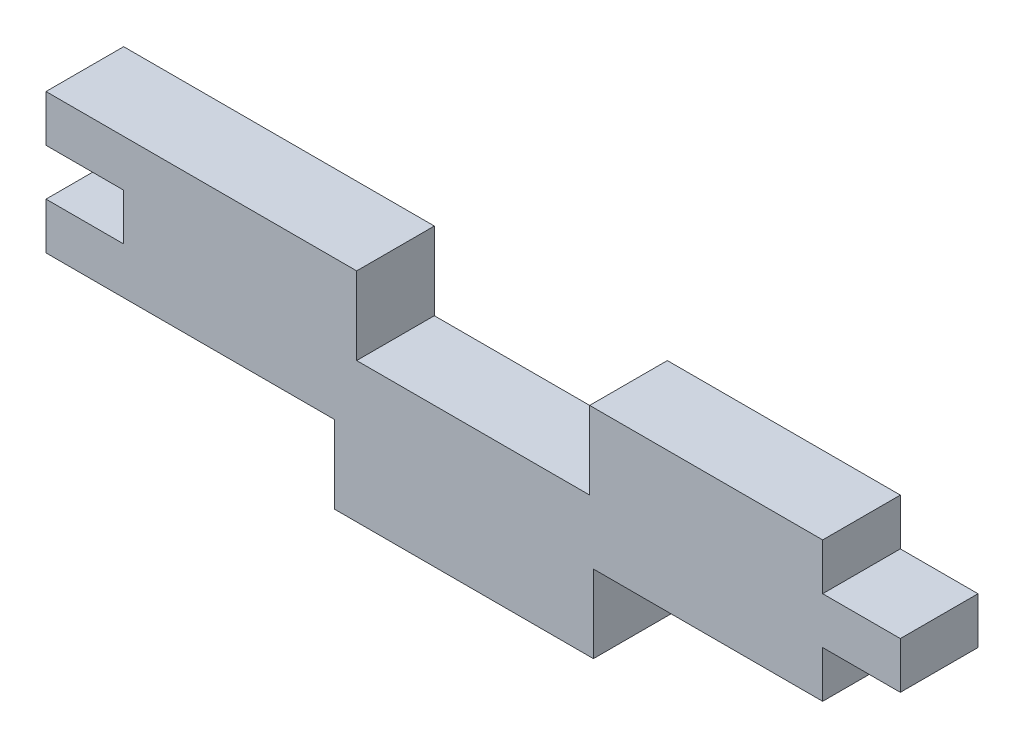
ISO-10303-21;
HEADER;
FILE_DESCRIPTION(('STEP AP214'),'2;1');
FILE_NAME('part.step','',(''),(''),'','','');
FILE_SCHEMA(('AUTOMOTIVE_DESIGN { 1 0 10303 214 1 1 1 1 }'));
ENDSEC;
DATA;
#1=APPLICATION_CONTEXT('core data for automotive mechanical design processes');
#2=APPLICATION_PROTOCOL_DEFINITION('international standard','automotive_design',2000,#1);
#3=PRODUCT_CONTEXT('',#1,'mechanical');
#4=PRODUCT('Part','Part','',(#3));
#5=PRODUCT_RELATED_PRODUCT_CATEGORY('part','',(#4));
#6=PRODUCT_DEFINITION_FORMATION('','',#4);
#7=PRODUCT_DEFINITION_CONTEXT('part definition',#1,'design');
#8=PRODUCT_DEFINITION('design','',#6,#7);
#9=PRODUCT_DEFINITION_SHAPE('','',#8);
#10=(LENGTH_UNIT() NAMED_UNIT(*) SI_UNIT(.MILLI.,.METRE.));
#11=(NAMED_UNIT(*) PLANE_ANGLE_UNIT() SI_UNIT($,.RADIAN.));
#12=(NAMED_UNIT(*) SI_UNIT($,.STERADIAN.) SOLID_ANGLE_UNIT());
#13=UNCERTAINTY_MEASURE_WITH_UNIT(LENGTH_MEASURE(1.E-05),#10,'distance_accuracy_value','');
#14=(GEOMETRIC_REPRESENTATION_CONTEXT(3) GLOBAL_UNCERTAINTY_ASSIGNED_CONTEXT((#13)) GLOBAL_UNIT_ASSIGNED_CONTEXT((#10,
#11,#12)) REPRESENTATION_CONTEXT('',''));
#15=CARTESIAN_POINT('',(0.,0.,0.));
#16=DIRECTION('',(0.,0.,1.));
#17=DIRECTION('',(1.,0.,0.));
#18=AXIS2_PLACEMENT_3D('',#15,#16,#17);
#19=CARTESIAN_POINT('',(-25.,4.5,5.));
#20=DIRECTION('',(0.,-1.,0.));
#21=DIRECTION('',(0.,0.,-1.));
#22=AXIS2_PLACEMENT_3D('',#19,#20,#21);
#23=PLANE('',#22);
#24=DIRECTION('',(0.,0.,-1.));
#25=VECTOR('',#24,1.);
#26=CARTESIAN_POINT('',(9.99999999999999,4.49999999999999,5.00000000000001));
#27=LINE('',#26,#25);
#28=CARTESIAN_POINT('',(9.99999999999999,4.49999999999999,5.00000000000001));
#29=VERTEX_POINT('',#28);
#30=CARTESIAN_POINT('',(9.99999999999999,4.49999999999999,0.));
#31=VERTEX_POINT('',#30);
#32=EDGE_CURVE('E315',#29,#31,#27,.T.);
#33=ORIENTED_EDGE('',*,*,#32,.F.);
#34=DIRECTION('',(-1.,0.,0.));
#35=VECTOR('',#34,1.);
#36=CARTESIAN_POINT('',(-25.,4.5,5.));
#37=LINE('',#36,#35);
#38=CARTESIAN_POINT('',(25.,4.5,5.));
#39=VERTEX_POINT('',#38);
#40=EDGE_CURVE('E312',#39,#29,#37,.T.);
#41=ORIENTED_EDGE('',*,*,#40,.F.);
#42=DIRECTION('',(0.,0.,-1.));
#43=VECTOR('',#42,1.);
#44=CARTESIAN_POINT('',(25.,4.5,5.));
#45=LINE('',#44,#43);
#46=CARTESIAN_POINT('',(25.,4.5,0.));
#47=VERTEX_POINT('',#46);
#48=EDGE_CURVE('E184',#39,#47,#45,.T.);
#49=ORIENTED_EDGE('',*,*,#48,.T.);
#50=DIRECTION('',(-1.,0.,0.));
#51=VECTOR('',#50,1.);
#52=CARTESIAN_POINT('',(-25.,4.5,0.));
#53=LINE('',#52,#51);
#54=EDGE_CURVE('E188',#47,#31,#53,.T.);
#55=ORIENTED_EDGE('',*,*,#54,.T.);
#56=EDGE_LOOP('',(#33,#41,#49,#55));
#57=FACE_BOUND('',#56,.T.);
#58=ADVANCED_FACE('F31',(#57),#23,.F.);
#59=DIRECTION('',(0.,0.,1.));
#60=VECTOR('',#59,1.);
#61=CARTESIAN_POINT('',(-5.00000000000001,4.49999999999999,5.00000000000001));
#62=LINE('',#61,#60);
#63=CARTESIAN_POINT('',(-5.00000000000001,4.49999999999999,0.));
#64=VERTEX_POINT('',#63);
#65=CARTESIAN_POINT('',(-5.00000000000001,4.49999999999999,5.00000000000001));
#66=VERTEX_POINT('',#65);
#67=EDGE_CURVE('E330',#64,#66,#62,.T.);
#68=ORIENTED_EDGE('',*,*,#67,.F.);
#69=CARTESIAN_POINT('',(-25.,4.5,0.));
#70=VERTEX_POINT('',#69);
#71=EDGE_CURVE('E192',#64,#70,#53,.T.);
#72=ORIENTED_EDGE('',*,*,#71,.T.);
#73=DIRECTION('',(0.,0.,-1.));
#74=VECTOR('',#73,1.);
#75=CARTESIAN_POINT('',(-25.,4.5,5.));
#76=LINE('',#75,#74);
#77=CARTESIAN_POINT('',(-25.,4.5,5.));
#78=VERTEX_POINT('',#77);
#79=EDGE_CURVE('E11',#78,#70,#76,.T.);
#80=ORIENTED_EDGE('',*,*,#79,.F.);
#81=EDGE_CURVE('E119',#66,#78,#37,.T.);
#82=ORIENTED_EDGE('',*,*,#81,.F.);
#83=EDGE_LOOP('',(#68,#72,#80,#82));
#84=FACE_BOUND('',#83,.T.);
#85=ADVANCED_FACE('F327',(#84),#23,.F.);
#86=CARTESIAN_POINT('',(25.,4.5,5.));
#87=DIRECTION('',(0.,0.,1.));
#88=DIRECTION('',(1.,0.,0.));
#89=AXIS2_PLACEMENT_3D('',#86,#87,#88);
#90=PLANE('',#89);
#91=DIRECTION('',(1.,0.,0.));
#92=VECTOR('',#91,1.);
#93=CARTESIAN_POINT('',(-25.,1.49999999999999,5.));
#94=LINE('',#93,#92);
#95=CARTESIAN_POINT('',(-25.,1.49999999999999,5.));
#96=VERTEX_POINT('',#95);
#97=CARTESIAN_POINT('',(-20.,1.5,5.));
#98=VERTEX_POINT('',#97);
#99=EDGE_CURVE('E259',#96,#98,#94,.T.);
#100=ORIENTED_EDGE('',*,*,#99,.T.);
#101=DIRECTION('',(0.,-1.,0.));
#102=VECTOR('',#101,1.);
#103=CARTESIAN_POINT('',(-20.,-1.5,5.));
#104=LINE('',#103,#102);
#105=CARTESIAN_POINT('',(-20.,-1.5,5.));
#106=VERTEX_POINT('',#105);
#107=EDGE_CURVE('E280',#98,#106,#104,.T.);
#108=ORIENTED_EDGE('',*,*,#107,.T.);
#109=DIRECTION('',(-1.,0.,0.));
#110=VECTOR('',#109,1.);
#111=CARTESIAN_POINT('',(-25.,-1.5,5.));
#112=LINE('',#111,#110);
#113=CARTESIAN_POINT('',(-25.,-1.5,5.));
#114=VERTEX_POINT('',#113);
#115=EDGE_CURVE('E277',#106,#114,#112,.T.);
#116=ORIENTED_EDGE('',*,*,#115,.T.);
#117=DIRECTION('',(0.,-1.,0.));
#118=VECTOR('',#117,1.);
#119=CARTESIAN_POINT('',(-25.,-4.5,5.));
#120=LINE('',#119,#118);
#121=CARTESIAN_POINT('',(-25.,-4.5,5.));
#122=VERTEX_POINT('',#121);
#123=EDGE_CURVE('E279',#114,#122,#120,.T.);
#124=ORIENTED_EDGE('',*,*,#123,.T.);
#125=DIRECTION('',(1.,0.,0.));
#126=VECTOR('',#125,1.);
#127=CARTESIAN_POINT('',(-25.,-4.5,5.));
#128=LINE('',#127,#126);
#129=CARTESIAN_POINT('',(-6.42413790767914,-4.5,5.));
#130=VERTEX_POINT('',#129);
#131=EDGE_CURVE('E282',#122,#130,#128,.T.);
#132=ORIENTED_EDGE('',*,*,#131,.T.);
#133=DIRECTION('',(0.,-1.,0.));
#134=VECTOR('',#133,1.);
#135=CARTESIAN_POINT('',(-6.42413790767914,-9.5,5.));
#136=LINE('',#135,#134);
#137=CARTESIAN_POINT('',(-6.42413790767914,-9.5,5.));
#138=VERTEX_POINT('',#137);
#139=EDGE_CURVE('E288',#130,#138,#136,.T.);
#140=ORIENTED_EDGE('',*,*,#139,.T.);
#141=DIRECTION('',(1.,0.,0.));
#142=VECTOR('',#141,1.);
#143=CARTESIAN_POINT('',(-6.42413790767914,-9.5,5.));
#144=LINE('',#143,#142);
#145=CARTESIAN_POINT('',(10.2425287589875,-9.5,5.));
#146=VERTEX_POINT('',#145);
#147=EDGE_CURVE('E290',#138,#146,#144,.T.);
#148=ORIENTED_EDGE('',*,*,#147,.T.);
#149=DIRECTION('',(0.,1.,0.));
#150=VECTOR('',#149,1.);
#151=CARTESIAN_POINT('',(10.2425287589875,-9.5,5.));
#152=LINE('',#151,#150);
#153=CARTESIAN_POINT('',(10.2425287589875,-4.5,5.));
#154=VERTEX_POINT('',#153);
#155=EDGE_CURVE('E292',#146,#154,#152,.T.);
#156=ORIENTED_EDGE('',*,*,#155,.T.);
#157=DIRECTION('',(1.,0.,0.));
#158=VECTOR('',#157,1.);
#159=CARTESIAN_POINT('',(10.2425287589875,-4.5,5.));
#160=LINE('',#159,#158);
#161=CARTESIAN_POINT('',(25.,-4.5,5.));
#162=VERTEX_POINT('',#161);
#163=EDGE_CURVE('E294',#154,#162,#160,.T.);
#164=ORIENTED_EDGE('',*,*,#163,.T.);
#165=DIRECTION('',(0.,1.,0.));
#166=VECTOR('',#165,1.);
#167=CARTESIAN_POINT('',(25.,-4.5,5.));
#168=LINE('',#167,#166);
#169=CARTESIAN_POINT('',(25.,-1.49999999999999,5.));
#170=VERTEX_POINT('',#169);
#171=EDGE_CURVE('E296',#162,#170,#168,.T.);
#172=ORIENTED_EDGE('',*,*,#171,.T.);
#173=DIRECTION('',(1.,0.,0.));
#174=VECTOR('',#173,1.);
#175=CARTESIAN_POINT('',(25.,-1.49999999999999,5.));
#176=LINE('',#175,#174);
#177=CARTESIAN_POINT('',(30.,-1.49999999999999,5.));
#178=VERTEX_POINT('',#177);
#179=EDGE_CURVE('E167',#170,#178,#176,.T.);
#180=ORIENTED_EDGE('',*,*,#179,.T.);
#181=DIRECTION('',(0.,1.,0.));
#182=VECTOR('',#181,1.);
#183=CARTESIAN_POINT('',(30.,-1.49999999999999,5.));
#184=LINE('',#183,#182);
#185=CARTESIAN_POINT('',(30.,1.50000000000001,5.));
#186=VERTEX_POINT('',#185);
#187=EDGE_CURVE('E160',#178,#186,#184,.T.);
#188=ORIENTED_EDGE('',*,*,#187,.T.);
#189=DIRECTION('',(-1.,0.,0.));
#190=VECTOR('',#189,1.);
#191=CARTESIAN_POINT('',(25.,1.49999999999999,5.));
#192=LINE('',#191,#190);
#193=CARTESIAN_POINT('',(25.,1.49999999999999,5.));
#194=VERTEX_POINT('',#193);
#195=EDGE_CURVE('E164',#186,#194,#192,.T.);
#196=ORIENTED_EDGE('',*,*,#195,.T.);
#197=DIRECTION('',(0.,1.,0.));
#198=VECTOR('',#197,1.);
#199=CARTESIAN_POINT('',(25.,1.49999999999999,5.));
#200=LINE('',#199,#198);
#201=EDGE_CURVE('E54',#194,#39,#200,.T.);
#202=ORIENTED_EDGE('',*,*,#201,.T.);
#203=ORIENTED_EDGE('',*,*,#40,.T.);
#204=DIRECTION('',(0.,-1.,0.));
#205=VECTOR('',#204,1.);
#206=CARTESIAN_POINT('',(9.99999999999999,4.49999999999999,5.00000000000001));
#207=LINE('',#206,#205);
#208=CARTESIAN_POINT('',(9.99999999999999,-0.500000000000011,5.00000000000001));
#209=VERTEX_POINT('',#208);
#210=EDGE_CURVE('E333',#29,#209,#207,.T.);
#211=ORIENTED_EDGE('',*,*,#210,.T.);
#212=DIRECTION('',(1.,0.,0.));
#213=VECTOR('',#212,1.);
#214=CARTESIAN_POINT('',(25.,-0.500000000000011,5.));
#215=LINE('',#214,#213);
#216=CARTESIAN_POINT('',(-5.00000000000001,-0.500000000000011,5.00000000000001));
#217=VERTEX_POINT('',#216);
#218=EDGE_CURVE('E321',#217,#209,#215,.T.);
#219=ORIENTED_EDGE('',*,*,#218,.F.);
#220=DIRECTION('',(0.,-1.,0.));
#221=VECTOR('',#220,1.);
#222=CARTESIAN_POINT('',(-5.00000000000001,4.49999999999999,5.00000000000001));
#223=LINE('',#222,#221);
#224=EDGE_CURVE('E346',#66,#217,#223,.T.);
#225=ORIENTED_EDGE('',*,*,#224,.F.);
#226=ORIENTED_EDGE('',*,*,#81,.T.);
#227=DIRECTION('',(0.,-1.,0.));
#228=VECTOR('',#227,1.);
#229=CARTESIAN_POINT('',(-25.,1.49999999999999,5.));
#230=LINE('',#229,#228);
#231=EDGE_CURVE('E317',#78,#96,#230,.T.);
#232=ORIENTED_EDGE('',*,*,#231,.T.);
#233=EDGE_LOOP('',(#100,#108,#116,#124,#132,#140,#148,#156,#164,#172,#180,#188,#196,#202,#203,
#211,#219,#225,#226,#232));
#234=FACE_BOUND('',#233,.T.);
#235=ADVANCED_FACE('F162',(#234),#90,.T.);
#236=CARTESIAN_POINT('',(25.,4.5,0.));
#237=DIRECTION('',(0.,0.,1.));
#238=DIRECTION('',(1.,0.,0.));
#239=AXIS2_PLACEMENT_3D('',#236,#237,#238);
#240=PLANE('',#239);
#241=DIRECTION('',(0.,-1.,0.));
#242=VECTOR('',#241,1.);
#243=CARTESIAN_POINT('',(9.99999999999999,4.49999999999999,0.));
#244=LINE('',#243,#242);
#245=CARTESIAN_POINT('',(9.99999999999999,-0.500000000000011,0.));
#246=VERTEX_POINT('',#245);
#247=EDGE_CURVE('E339',#31,#246,#244,.T.);
#248=ORIENTED_EDGE('',*,*,#247,.F.);
#249=ORIENTED_EDGE('',*,*,#54,.F.);
#250=DIRECTION('',(0.,1.,0.));
#251=VECTOR('',#250,1.);
#252=CARTESIAN_POINT('',(25.,1.49999999999999,0.));
#253=LINE('',#252,#251);
#254=CARTESIAN_POINT('',(25.,1.49999999999999,0.));
#255=VERTEX_POINT('',#254);
#256=EDGE_CURVE('E111',#255,#47,#253,.T.);
#257=ORIENTED_EDGE('',*,*,#256,.F.);
#258=DIRECTION('',(-1.,0.,0.));
#259=VECTOR('',#258,1.);
#260=CARTESIAN_POINT('',(25.,1.49999999999999,0.));
#261=LINE('',#260,#259);
#262=CARTESIAN_POINT('',(30.,1.50000000000001,0.));
#263=VERTEX_POINT('',#262);
#264=EDGE_CURVE('E217',#263,#255,#261,.T.);
#265=ORIENTED_EDGE('',*,*,#264,.F.);
#266=DIRECTION('',(0.,1.,0.));
#267=VECTOR('',#266,1.);
#268=CARTESIAN_POINT('',(30.,-1.49999999999999,0.));
#269=LINE('',#268,#267);
#270=CARTESIAN_POINT('',(30.,-1.49999999999999,0.));
#271=VERTEX_POINT('',#270);
#272=EDGE_CURVE('E176',#271,#263,#269,.T.);
#273=ORIENTED_EDGE('',*,*,#272,.F.);
#274=DIRECTION('',(1.,0.,0.));
#275=VECTOR('',#274,1.);
#276=CARTESIAN_POINT('',(25.,-1.49999999999999,0.));
#277=LINE('',#276,#275);
#278=CARTESIAN_POINT('',(25.,-1.49999999999999,0.));
#279=VERTEX_POINT('',#278);
#280=EDGE_CURVE('E214',#279,#271,#277,.T.);
#281=ORIENTED_EDGE('',*,*,#280,.F.);
#282=DIRECTION('',(0.,1.,0.));
#283=VECTOR('',#282,1.);
#284=CARTESIAN_POINT('',(25.,-4.5,0.));
#285=LINE('',#284,#283);
#286=CARTESIAN_POINT('',(25.,-4.5,0.));
#287=VERTEX_POINT('',#286);
#288=EDGE_CURVE('E212',#287,#279,#285,.T.);
#289=ORIENTED_EDGE('',*,*,#288,.F.);
#290=DIRECTION('',(1.,0.,0.));
#291=VECTOR('',#290,1.);
#292=CARTESIAN_POINT('',(10.2425287589875,-4.5,0.));
#293=LINE('',#292,#291);
#294=CARTESIAN_POINT('',(10.2425287589875,-4.5,0.));
#295=VERTEX_POINT('',#294);
#296=EDGE_CURVE('E210',#295,#287,#293,.T.);
#297=ORIENTED_EDGE('',*,*,#296,.F.);
#298=DIRECTION('',(0.,1.,0.));
#299=VECTOR('',#298,1.);
#300=CARTESIAN_POINT('',(10.2425287589875,-9.5,0.));
#301=LINE('',#300,#299);
#302=CARTESIAN_POINT('',(10.2425287589875,-9.5,0.));
#303=VERTEX_POINT('',#302);
#304=EDGE_CURVE('E208',#303,#295,#301,.T.);
#305=ORIENTED_EDGE('',*,*,#304,.F.);
#306=DIRECTION('',(1.,0.,0.));
#307=VECTOR('',#306,1.);
#308=CARTESIAN_POINT('',(-6.42413790767914,-9.5,0.));
#309=LINE('',#308,#307);
#310=CARTESIAN_POINT('',(-6.42413790767914,-9.5,0.));
#311=VERTEX_POINT('',#310);
#312=EDGE_CURVE('E206',#311,#303,#309,.T.);
#313=ORIENTED_EDGE('',*,*,#312,.F.);
#314=DIRECTION('',(0.,-1.,0.));
#315=VECTOR('',#314,1.);
#316=CARTESIAN_POINT('',(-6.42413790767914,-9.5,0.));
#317=LINE('',#316,#315);
#318=CARTESIAN_POINT('',(-6.42413790767914,-4.5,0.));
#319=VERTEX_POINT('',#318);
#320=EDGE_CURVE('E204',#319,#311,#317,.T.);
#321=ORIENTED_EDGE('',*,*,#320,.F.);
#322=DIRECTION('',(1.,0.,0.));
#323=VECTOR('',#322,1.);
#324=CARTESIAN_POINT('',(-25.,-4.5,0.));
#325=LINE('',#324,#323);
#326=CARTESIAN_POINT('',(-25.,-4.5,0.));
#327=VERTEX_POINT('',#326);
#328=EDGE_CURVE('E202',#327,#319,#325,.T.);
#329=ORIENTED_EDGE('',*,*,#328,.F.);
#330=DIRECTION('',(0.,-1.,0.));
#331=VECTOR('',#330,1.);
#332=CARTESIAN_POINT('',(-25.,-4.5,0.));
#333=LINE('',#332,#331);
#334=CARTESIAN_POINT('',(-25.,-1.5,0.));
#335=VERTEX_POINT('',#334);
#336=EDGE_CURVE('E200',#335,#327,#333,.T.);
#337=ORIENTED_EDGE('',*,*,#336,.F.);
#338=DIRECTION('',(-1.,0.,0.));
#339=VECTOR('',#338,1.);
#340=CARTESIAN_POINT('',(-25.,-1.5,0.));
#341=LINE('',#340,#339);
#342=CARTESIAN_POINT('',(-20.,-1.5,0.));
#343=VERTEX_POINT('',#342);
#344=EDGE_CURVE('E198',#343,#335,#341,.T.);
#345=ORIENTED_EDGE('',*,*,#344,.F.);
#346=DIRECTION('',(0.,-1.,0.));
#347=VECTOR('',#346,1.);
#348=CARTESIAN_POINT('',(-20.,-1.5,0.));
#349=LINE('',#348,#347);
#350=CARTESIAN_POINT('',(-20.,1.5,0.));
#351=VERTEX_POINT('',#350);
#352=EDGE_CURVE('E196',#351,#343,#349,.T.);
#353=ORIENTED_EDGE('',*,*,#352,.F.);
#354=DIRECTION('',(1.,0.,0.));
#355=VECTOR('',#354,1.);
#356=CARTESIAN_POINT('',(-25.,1.49999999999999,0.));
#357=LINE('',#356,#355);
#358=CARTESIAN_POINT('',(-25.,1.49999999999999,0.));
#359=VERTEX_POINT('',#358);
#360=EDGE_CURVE('E194',#359,#351,#357,.T.);
#361=ORIENTED_EDGE('',*,*,#360,.F.);
#362=DIRECTION('',(0.,-1.,0.));
#363=VECTOR('',#362,1.);
#364=CARTESIAN_POINT('',(-25.,1.49999999999999,0.));
#365=LINE('',#364,#363);
#366=EDGE_CURVE('E191',#70,#359,#365,.T.);
#367=ORIENTED_EDGE('',*,*,#366,.F.);
#368=ORIENTED_EDGE('',*,*,#71,.F.);
#369=DIRECTION('',(0.,-1.,0.));
#370=VECTOR('',#369,1.);
#371=CARTESIAN_POINT('',(-5.00000000000001,4.49999999999999,0.));
#372=LINE('',#371,#370);
#373=CARTESIAN_POINT('',(-5.00000000000001,-0.500000000000011,0.));
#374=VERTEX_POINT('',#373);
#375=EDGE_CURVE('E342',#64,#374,#372,.T.);
#376=ORIENTED_EDGE('',*,*,#375,.T.);
#377=DIRECTION('',(-1.,0.,0.));
#378=VECTOR('',#377,1.);
#379=CARTESIAN_POINT('',(-5.00000000000001,-0.500000000000011,0.));
#380=LINE('',#379,#378);
#381=EDGE_CURVE('E349',#246,#374,#380,.T.);
#382=ORIENTED_EDGE('',*,*,#381,.F.);
#383=EDGE_LOOP('',(#248,#249,#257,#265,#273,#281,#289,#297,#305,#313,#321,#329,#337,#345,#353,
#361,#367,#368,#376,#382));
#384=FACE_BOUND('',#383,.T.);
#385=ADVANCED_FACE('F265',(#384),#240,.F.);
#386=CARTESIAN_POINT('',(-25.,1.49999999999999,5.));
#387=DIRECTION('',(1.,0.,0.));
#388=DIRECTION('',(0.,1.,0.));
#389=AXIS2_PLACEMENT_3D('',#386,#387,#388);
#390=PLANE('',#389);
#391=ORIENTED_EDGE('',*,*,#366,.T.);
#392=DIRECTION('',(0.,0.,-1.));
#393=VECTOR('',#392,1.);
#394=CARTESIAN_POINT('',(-25.,1.49999999999999,5.));
#395=LINE('',#394,#393);
#396=EDGE_CURVE('E38',#96,#359,#395,.T.);
#397=ORIENTED_EDGE('',*,*,#396,.F.);
#398=ORIENTED_EDGE('',*,*,#231,.F.);
#399=ORIENTED_EDGE('',*,*,#79,.T.);
#400=EDGE_LOOP('',(#391,#397,#398,#399));
#401=FACE_BOUND('',#400,.T.);
#402=ADVANCED_FACE('F324',(#401),#390,.F.);
#403=CARTESIAN_POINT('',(-25.,1.49999999999999,5.));
#404=DIRECTION('',(0.,1.,0.));
#405=DIRECTION('',(-1.,0.,0.));
#406=AXIS2_PLACEMENT_3D('',#403,#404,#405);
#407=PLANE('',#406);
#408=ORIENTED_EDGE('',*,*,#360,.T.);
#409=DIRECTION('',(0.,0.,-1.));
#410=VECTOR('',#409,1.);
#411=CARTESIAN_POINT('',(-20.,1.5,5.));
#412=LINE('',#411,#410);
#413=EDGE_CURVE('E250',#98,#351,#412,.T.);
#414=ORIENTED_EDGE('',*,*,#413,.F.);
#415=ORIENTED_EDGE('',*,*,#99,.F.);
#416=ORIENTED_EDGE('',*,*,#396,.T.);
#417=EDGE_LOOP('',(#408,#414,#415,#416));
#418=FACE_BOUND('',#417,.T.);
#419=ADVANCED_FACE('F257',(#418),#407,.F.);
#420=CARTESIAN_POINT('',(-20.,-1.5,5.));
#421=DIRECTION('',(1.,0.,0.));
#422=DIRECTION('',(0.,0.,-1.));
#423=AXIS2_PLACEMENT_3D('',#420,#421,#422);
#424=PLANE('',#423);
#425=ORIENTED_EDGE('',*,*,#352,.T.);
#426=DIRECTION('',(0.,0.,-1.));
#427=VECTOR('',#426,1.);
#428=CARTESIAN_POINT('',(-20.,-1.5,5.));
#429=LINE('',#428,#427);
#430=EDGE_CURVE('E247',#106,#343,#429,.T.);
#431=ORIENTED_EDGE('',*,*,#430,.F.);
#432=ORIENTED_EDGE('',*,*,#107,.F.);
#433=ORIENTED_EDGE('',*,*,#413,.T.);
#434=EDGE_LOOP('',(#425,#431,#432,#433));
#435=FACE_BOUND('',#434,.T.);
#436=ADVANCED_FACE('F271',(#435),#424,.F.);
#437=CARTESIAN_POINT('',(-25.,-1.5,5.));
#438=DIRECTION('',(0.,-1.,0.));
#439=DIRECTION('',(0.,0.,-1.));
#440=AXIS2_PLACEMENT_3D('',#437,#438,#439);
#441=PLANE('',#440);
#442=ORIENTED_EDGE('',*,*,#344,.T.);
#443=DIRECTION('',(0.,0.,-1.));
#444=VECTOR('',#443,1.);
#445=CARTESIAN_POINT('',(-25.,-1.5,5.));
#446=LINE('',#445,#444);
#447=EDGE_CURVE('E244',#114,#335,#446,.T.);
#448=ORIENTED_EDGE('',*,*,#447,.F.);
#449=ORIENTED_EDGE('',*,*,#115,.F.);
#450=ORIENTED_EDGE('',*,*,#430,.T.);
#451=EDGE_LOOP('',(#442,#448,#449,#450));
#452=FACE_BOUND('',#451,.T.);
#453=ADVANCED_FACE('F275',(#452),#441,.F.);
#454=CARTESIAN_POINT('',(-25.,-4.5,5.));
#455=DIRECTION('',(1.,0.,0.));
#456=DIRECTION('',(0.,0.,-1.));
#457=AXIS2_PLACEMENT_3D('',#454,#455,#456);
#458=PLANE('',#457);
#459=ORIENTED_EDGE('',*,*,#336,.T.);
#460=DIRECTION('',(0.,0.,-1.));
#461=VECTOR('',#460,1.);
#462=CARTESIAN_POINT('',(-25.,-4.5,5.));
#463=LINE('',#462,#461);
#464=EDGE_CURVE('E241',#122,#327,#463,.T.);
#465=ORIENTED_EDGE('',*,*,#464,.F.);
#466=ORIENTED_EDGE('',*,*,#123,.F.);
#467=ORIENTED_EDGE('',*,*,#447,.T.);
#468=EDGE_LOOP('',(#459,#465,#466,#467));
#469=FACE_BOUND('',#468,.T.);
#470=ADVANCED_FACE('F416',(#469),#458,.F.);
#471=CARTESIAN_POINT('',(-25.,-4.5,5.));
#472=DIRECTION('',(0.,1.,0.));
#473=DIRECTION('',(0.,0.,1.));
#474=AXIS2_PLACEMENT_3D('',#471,#472,#473);
#475=PLANE('',#474);
#476=ORIENTED_EDGE('',*,*,#328,.T.);
#477=DIRECTION('',(0.,0.,-1.));
#478=VECTOR('',#477,1.);
#479=CARTESIAN_POINT('',(-6.42413790767914,-4.5,5.));
#480=LINE('',#479,#478);
#481=EDGE_CURVE('E238',#130,#319,#480,.T.);
#482=ORIENTED_EDGE('',*,*,#481,.F.);
#483=ORIENTED_EDGE('',*,*,#131,.F.);
#484=ORIENTED_EDGE('',*,*,#464,.T.);
#485=EDGE_LOOP('',(#476,#482,#483,#484));
#486=FACE_BOUND('',#485,.T.);
#487=ADVANCED_FACE('F412',(#486),#475,.F.);
#488=CARTESIAN_POINT('',(-6.42413790767914,-9.5,5.));
#489=DIRECTION('',(1.,0.,0.));
#490=DIRECTION('',(0.,0.,-1.));
#491=AXIS2_PLACEMENT_3D('',#488,#489,#490);
#492=PLANE('',#491);
#493=ORIENTED_EDGE('',*,*,#320,.T.);
#494=DIRECTION('',(0.,0.,-1.));
#495=VECTOR('',#494,1.);
#496=CARTESIAN_POINT('',(-6.42413790767914,-9.5,5.));
#497=LINE('',#496,#495);
#498=EDGE_CURVE('E235',#138,#311,#497,.T.);
#499=ORIENTED_EDGE('',*,*,#498,.F.);
#500=ORIENTED_EDGE('',*,*,#139,.F.);
#501=ORIENTED_EDGE('',*,*,#481,.T.);
#502=EDGE_LOOP('',(#493,#499,#500,#501));
#503=FACE_BOUND('',#502,.T.);
#504=ADVANCED_FACE('F408',(#503),#492,.F.);
#505=CARTESIAN_POINT('',(-6.42413790767914,-9.5,5.));
#506=DIRECTION('',(0.,1.,0.));
#507=DIRECTION('',(0.,0.,1.));
#508=AXIS2_PLACEMENT_3D('',#505,#506,#507);
#509=PLANE('',#508);
#510=ORIENTED_EDGE('',*,*,#312,.T.);
#511=DIRECTION('',(0.,0.,-1.));
#512=VECTOR('',#511,1.);
#513=CARTESIAN_POINT('',(10.2425287589875,-9.5,5.));
#514=LINE('',#513,#512);
#515=EDGE_CURVE('E232',#146,#303,#514,.T.);
#516=ORIENTED_EDGE('',*,*,#515,.F.);
#517=ORIENTED_EDGE('',*,*,#147,.F.);
#518=ORIENTED_EDGE('',*,*,#498,.T.);
#519=EDGE_LOOP('',(#510,#516,#517,#518));
#520=FACE_BOUND('',#519,.T.);
#521=ADVANCED_FACE('F404',(#520),#509,.F.);
#522=CARTESIAN_POINT('',(10.2425287589875,-9.5,5.));
#523=DIRECTION('',(-1.,0.,0.));
#524=DIRECTION('',(0.,0.,1.));
#525=AXIS2_PLACEMENT_3D('',#522,#523,#524);
#526=PLANE('',#525);
#527=ORIENTED_EDGE('',*,*,#304,.T.);
#528=DIRECTION('',(0.,0.,-1.));
#529=VECTOR('',#528,1.);
#530=CARTESIAN_POINT('',(10.2425287589875,-4.5,5.));
#531=LINE('',#530,#529);
#532=EDGE_CURVE('E229',#154,#295,#531,.T.);
#533=ORIENTED_EDGE('',*,*,#532,.F.);
#534=ORIENTED_EDGE('',*,*,#155,.F.);
#535=ORIENTED_EDGE('',*,*,#515,.T.);
#536=EDGE_LOOP('',(#527,#533,#534,#535));
#537=FACE_BOUND('',#536,.T.);
#538=ADVANCED_FACE('F400',(#537),#526,.F.);
#539=CARTESIAN_POINT('',(10.2425287589875,-4.5,5.));
#540=DIRECTION('',(0.,1.,0.));
#541=DIRECTION('',(0.,0.,1.));
#542=AXIS2_PLACEMENT_3D('',#539,#540,#541);
#543=PLANE('',#542);
#544=ORIENTED_EDGE('',*,*,#296,.T.);
#545=DIRECTION('',(0.,0.,-1.));
#546=VECTOR('',#545,1.);
#547=CARTESIAN_POINT('',(25.,-4.5,5.));
#548=LINE('',#547,#546);
#549=EDGE_CURVE('E226',#162,#287,#548,.T.);
#550=ORIENTED_EDGE('',*,*,#549,.F.);
#551=ORIENTED_EDGE('',*,*,#163,.F.);
#552=ORIENTED_EDGE('',*,*,#532,.T.);
#553=EDGE_LOOP('',(#544,#550,#551,#552));
#554=FACE_BOUND('',#553,.T.);
#555=ADVANCED_FACE('F397',(#554),#543,.F.);
#556=CARTESIAN_POINT('',(25.,-4.5,5.));
#557=DIRECTION('',(-1.,0.,0.));
#558=DIRECTION('',(0.,0.,1.));
#559=AXIS2_PLACEMENT_3D('',#556,#557,#558);
#560=PLANE('',#559);
#561=ORIENTED_EDGE('',*,*,#288,.T.);
#562=DIRECTION('',(0.,0.,-1.));
#563=VECTOR('',#562,1.);
#564=CARTESIAN_POINT('',(25.,-1.49999999999999,5.));
#565=LINE('',#564,#563);
#566=EDGE_CURVE('E223',#170,#279,#565,.T.);
#567=ORIENTED_EDGE('',*,*,#566,.F.);
#568=ORIENTED_EDGE('',*,*,#171,.F.);
#569=ORIENTED_EDGE('',*,*,#549,.T.);
#570=EDGE_LOOP('',(#561,#567,#568,#569));
#571=FACE_BOUND('',#570,.T.);
#572=ADVANCED_FACE('F302',(#571),#560,.F.);
#573=CARTESIAN_POINT('',(25.,-1.49999999999999,5.));
#574=DIRECTION('',(0.,1.,0.));
#575=DIRECTION('',(0.,0.,1.));
#576=AXIS2_PLACEMENT_3D('',#573,#574,#575);
#577=PLANE('',#576);
#578=ORIENTED_EDGE('',*,*,#280,.T.);
#579=DIRECTION('',(0.,0.,-1.));
#580=VECTOR('',#579,1.);
#581=CARTESIAN_POINT('',(30.,-1.49999999999999,5.));
#582=LINE('',#581,#580);
#583=EDGE_CURVE('E179',#178,#271,#582,.T.);
#584=ORIENTED_EDGE('',*,*,#583,.F.);
#585=ORIENTED_EDGE('',*,*,#179,.F.);
#586=ORIENTED_EDGE('',*,*,#566,.T.);
#587=EDGE_LOOP('',(#578,#584,#585,#586));
#588=FACE_BOUND('',#587,.T.);
#589=ADVANCED_FACE('F306',(#588),#577,.F.);
#590=CARTESIAN_POINT('',(30.,-1.49999999999999,5.));
#591=DIRECTION('',(-1.,0.,0.));
#592=DIRECTION('',(0.,0.,1.));
#593=AXIS2_PLACEMENT_3D('',#590,#591,#592);
#594=PLANE('',#593);
#595=ORIENTED_EDGE('',*,*,#272,.T.);
#596=DIRECTION('',(0.,0.,-1.));
#597=VECTOR('',#596,1.);
#598=CARTESIAN_POINT('',(30.,1.50000000000001,5.));
#599=LINE('',#598,#597);
#600=EDGE_CURVE('E173',#186,#263,#599,.T.);
#601=ORIENTED_EDGE('',*,*,#600,.F.);
#602=ORIENTED_EDGE('',*,*,#187,.F.);
#603=ORIENTED_EDGE('',*,*,#583,.T.);
#604=EDGE_LOOP('',(#595,#601,#602,#603));
#605=FACE_BOUND('',#604,.T.);
#606=ADVANCED_FACE('F174',(#605),#594,.F.);
#607=CARTESIAN_POINT('',(25.,1.49999999999999,5.));
#608=DIRECTION('',(0.,-1.,0.));
#609=DIRECTION('',(1.,0.,0.));
#610=AXIS2_PLACEMENT_3D('',#607,#608,#609);
#611=PLANE('',#610);
#612=ORIENTED_EDGE('',*,*,#264,.T.);
#613=DIRECTION('',(0.,0.,-1.));
#614=VECTOR('',#613,1.);
#615=CARTESIAN_POINT('',(25.,1.49999999999999,5.));
#616=LINE('',#615,#614);
#617=EDGE_CURVE('E180',#194,#255,#616,.T.);
#618=ORIENTED_EDGE('',*,*,#617,.F.);
#619=ORIENTED_EDGE('',*,*,#195,.F.);
#620=ORIENTED_EDGE('',*,*,#600,.T.);
#621=EDGE_LOOP('',(#612,#618,#619,#620));
#622=FACE_BOUND('',#621,.T.);
#623=ADVANCED_FACE('F182',(#622),#611,.F.);
#624=CARTESIAN_POINT('',(25.,1.49999999999999,5.));
#625=DIRECTION('',(-1.,0.,0.));
#626=DIRECTION('',(0.,-1.,0.));
#627=AXIS2_PLACEMENT_3D('',#624,#625,#626);
#628=PLANE('',#627);
#629=ORIENTED_EDGE('',*,*,#256,.T.);
#630=ORIENTED_EDGE('',*,*,#48,.F.);
#631=ORIENTED_EDGE('',*,*,#201,.F.);
#632=ORIENTED_EDGE('',*,*,#617,.T.);
#633=EDGE_LOOP('',(#629,#630,#631,#632));
#634=FACE_BOUND('',#633,.T.);
#635=ADVANCED_FACE('F308',(#634),#628,.F.);
#636=CARTESIAN_POINT('',(25.,-0.500000000000011,50.));
#637=DIRECTION('',(0.,-1.,0.));
#638=DIRECTION('',(0.,0.,-1.));
#639=AXIS2_PLACEMENT_3D('',#636,#637,#638);
#640=PLANE('',#639);
#641=ORIENTED_EDGE('',*,*,#218,.T.);
#642=DIRECTION('',(0.,0.,-1.));
#643=VECTOR('',#642,1.);
#644=CARTESIAN_POINT('',(9.99999999999999,-0.500000000000011,5.00000000000001));
#645=LINE('',#644,#643);
#646=EDGE_CURVE('E351',#209,#246,#645,.T.);
#647=ORIENTED_EDGE('',*,*,#646,.T.);
#648=ORIENTED_EDGE('',*,*,#381,.T.);
#649=DIRECTION('',(0.,0.,1.));
#650=VECTOR('',#649,1.);
#651=CARTESIAN_POINT('',(-5.00000000000001,-0.500000000000011,5.00000000000001));
#652=LINE('',#651,#650);
#653=EDGE_CURVE('E45',#374,#217,#652,.T.);
#654=ORIENTED_EDGE('',*,*,#653,.T.);
#655=EDGE_LOOP('',(#641,#647,#648,#654));
#656=FACE_BOUND('',#655,.T.);
#657=ADVANCED_FACE('F360',(#656),#640,.F.);
#658=CARTESIAN_POINT('',(9.99999999999999,4.49999999999999,5.00000000000001));
#659=DIRECTION('',(-1.,0.,0.));
#660=DIRECTION('',(0.,0.,1.));
#661=AXIS2_PLACEMENT_3D('',#658,#659,#660);
#662=PLANE('',#661);
#663=ORIENTED_EDGE('',*,*,#646,.F.);
#664=ORIENTED_EDGE('',*,*,#210,.F.);
#665=ORIENTED_EDGE('',*,*,#32,.T.);
#666=ORIENTED_EDGE('',*,*,#247,.T.);
#667=EDGE_LOOP('',(#663,#664,#665,#666));
#668=FACE_BOUND('',#667,.T.);
#669=ADVANCED_FACE('F356',(#668),#662,.T.);
#670=CARTESIAN_POINT('',(-5.00000000000001,4.49999999999999,5.00000000000001));
#671=DIRECTION('',(1.,0.,0.));
#672=DIRECTION('',(0.,1.,0.));
#673=AXIS2_PLACEMENT_3D('',#670,#671,#672);
#674=PLANE('',#673);
#675=ORIENTED_EDGE('',*,*,#653,.F.);
#676=ORIENTED_EDGE('',*,*,#375,.F.);
#677=ORIENTED_EDGE('',*,*,#67,.T.);
#678=ORIENTED_EDGE('',*,*,#224,.T.);
#679=EDGE_LOOP('',(#675,#676,#677,#678));
#680=FACE_BOUND('',#679,.T.);
#681=ADVANCED_FACE('F365',(#680),#674,.T.);
#682=CLOSED_SHELL('',(#58,#85,#235,#385,#402,#419,#436,#453,#470,#487,#504,#521,#538,#555,#572,
#589,#606,#623,#635,#657,#669,#681));
#683=MANIFOLD_SOLID_BREP('B2',#682);
#684=ADVANCED_BREP_SHAPE_REPRESENTATION('',(#18,#683),#14);
#685=SHAPE_DEFINITION_REPRESENTATION(#9,#684);
ENDSEC;
END-ISO-10303-21;
